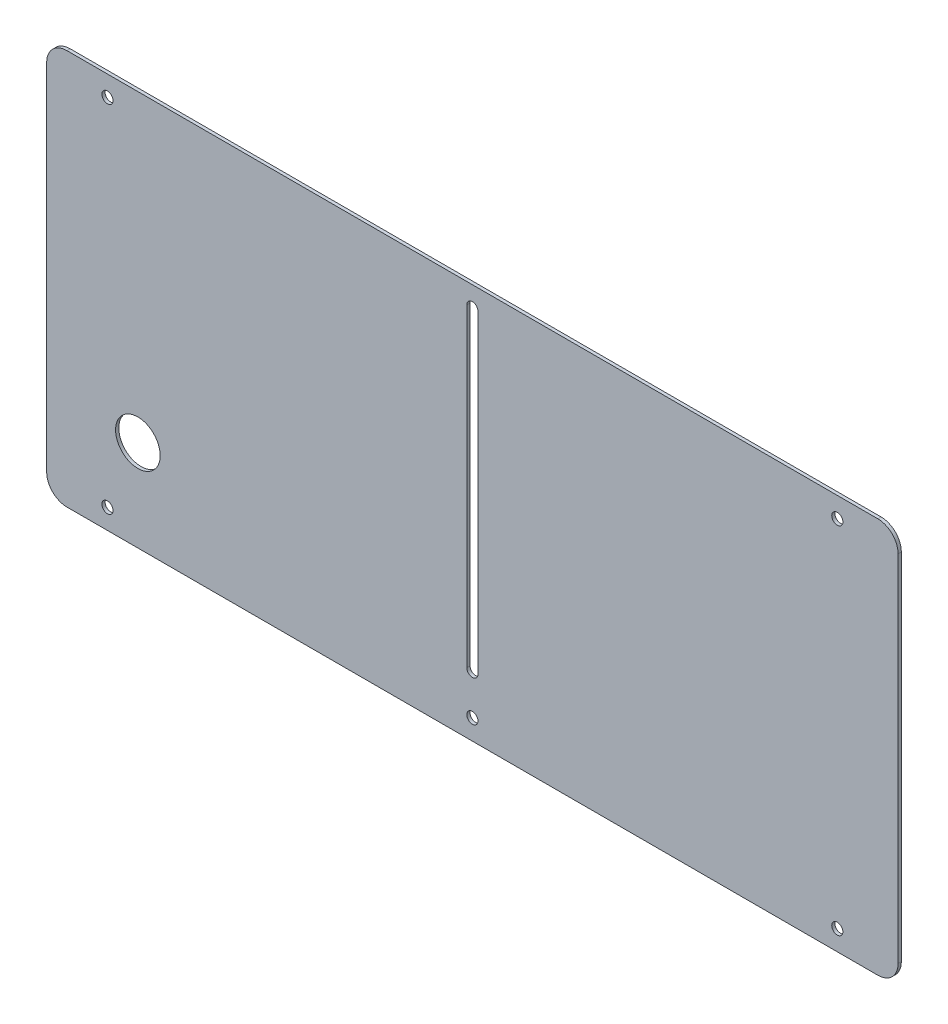
ISO-10303-21;
HEADER;
FILE_DESCRIPTION(('STEP AP214'),'2;1');
FILE_NAME('part.step','',(''),(''),'','','');
FILE_SCHEMA(('AUTOMOTIVE_DESIGN { 1 0 10303 214 1 1 1 1 }'));
ENDSEC;
DATA;
#1=APPLICATION_CONTEXT('core data for automotive mechanical design processes');
#2=APPLICATION_PROTOCOL_DEFINITION('international standard','automotive_design',2000,#1);
#3=PRODUCT_CONTEXT('',#1,'mechanical');
#4=PRODUCT('Part','Part','',(#3));
#5=PRODUCT_RELATED_PRODUCT_CATEGORY('part','',(#4));
#6=PRODUCT_DEFINITION_FORMATION('','',#4);
#7=PRODUCT_DEFINITION_CONTEXT('part definition',#1,'design');
#8=PRODUCT_DEFINITION('design','',#6,#7);
#9=PRODUCT_DEFINITION_SHAPE('','',#8);
#10=(LENGTH_UNIT() NAMED_UNIT(*) SI_UNIT(.MILLI.,.METRE.));
#11=(NAMED_UNIT(*) PLANE_ANGLE_UNIT() SI_UNIT($,.RADIAN.));
#12=(NAMED_UNIT(*) SI_UNIT($,.STERADIAN.) SOLID_ANGLE_UNIT());
#13=UNCERTAINTY_MEASURE_WITH_UNIT(LENGTH_MEASURE(1.E-05),#10,'distance_accuracy_value','');
#14=(GEOMETRIC_REPRESENTATION_CONTEXT(3) GLOBAL_UNCERTAINTY_ASSIGNED_CONTEXT((#13)) GLOBAL_UNIT_ASSIGNED_CONTEXT((#10,
#11,#12)) REPRESENTATION_CONTEXT('',''));
#15=CARTESIAN_POINT('',(0.,0.,0.));
#16=DIRECTION('',(0.,0.,1.));
#17=DIRECTION('',(1.,0.,0.));
#18=AXIS2_PLACEMENT_3D('',#15,#16,#17);
#19=CARTESIAN_POINT('',(2.72527919099535E-13,0.,-343.508212503052));
#20=DIRECTION('',(0.,0.,-1.));
#21=DIRECTION('',(-1.,0.,0.));
#22=AXIS2_PLACEMENT_3D('',#19,#20,#21);
#23=PLANE('',#22);
#24=CARTESIAN_POINT('',(180.0102,-72.5898,-343.508212503052));
#25=DIRECTION('',(0.,0.,-1.));
#26=DIRECTION('',(-1.,0.,0.));
#27=AXIS2_PLACEMENT_3D('',#24,#25,#26);
#28=CIRCLE('',#27,2.75000000000001);
#29=CARTESIAN_POINT('',(177.2602,-72.5898,-343.508212503052));
#30=VERTEX_POINT('',#29);
#31=EDGE_CURVE('E460',#30,#30,#28,.T.);
#32=ORIENTED_EDGE('',*,*,#31,.F.);
#33=EDGE_LOOP('',(#32));
#34=FACE_BOUND('',#33,.T.);
#35=CARTESIAN_POINT('',(-180.010199999999,-72.5898,-343.508212503052));
#36=DIRECTION('',(0.,0.,-1.));
#37=DIRECTION('',(-1.,0.,0.));
#38=AXIS2_PLACEMENT_3D('',#35,#36,#37);
#39=CIRCLE('',#38,2.75000000000001);
#40=CARTESIAN_POINT('',(-182.760199999999,-72.5898,-343.508212503052));
#41=VERTEX_POINT('',#40);
#42=EDGE_CURVE('E483',#41,#41,#39,.T.);
#43=ORIENTED_EDGE('',*,*,#42,.F.);
#44=EDGE_LOOP('',(#43));
#45=FACE_BOUND('',#44,.T.);
#46=CARTESIAN_POINT('',(-180.010199999999,102.5153,-343.508212503052));
#47=DIRECTION('',(0.,0.,-1.));
#48=DIRECTION('',(1.,0.,0.));
#49=AXIS2_PLACEMENT_3D('',#46,#47,#48);
#50=CIRCLE('',#49,2.75000000000001);
#51=CARTESIAN_POINT('',(-177.260199999999,102.5153,-343.508212503052));
#52=VERTEX_POINT('',#51);
#53=EDGE_CURVE('E464',#52,#52,#50,.T.);
#54=ORIENTED_EDGE('',*,*,#53,.F.);
#55=EDGE_LOOP('',(#54));
#56=FACE_BOUND('',#55,.T.);
#57=CARTESIAN_POINT('',(0.,-72.4998,-343.508212503052));
#58=DIRECTION('',(0.,0.,-1.));
#59=DIRECTION('',(-1.,0.,0.));
#60=AXIS2_PLACEMENT_3D('',#57,#58,#59);
#61=CIRCLE('',#60,2.75);
#62=CARTESIAN_POINT('',(-2.75000000000003,-72.4998,-343.508212503052));
#63=VERTEX_POINT('',#62);
#64=EDGE_CURVE('E161',#63,#63,#61,.T.);
#65=ORIENTED_EDGE('',*,*,#64,.F.);
#66=EDGE_LOOP('',(#65));
#67=FACE_BOUND('',#66,.T.);
#68=DIRECTION('',(0.,-1.,0.));
#69=VECTOR('',#68,1.);
#70=CARTESIAN_POINT('',(210.,112.5102,-343.508212503052));
#71=LINE('',#70,#69);
#72=CARTESIAN_POINT('',(210.,102.5102,-343.508212503052));
#73=VERTEX_POINT('',#72);
#74=CARTESIAN_POINT('',(210.,-72.4898,-343.508212503052));
#75=VERTEX_POINT('',#74);
#76=EDGE_CURVE('E172',#73,#75,#71,.T.);
#77=ORIENTED_EDGE('',*,*,#76,.T.);
#78=CARTESIAN_POINT('',(200.,-72.4898,-343.508212503052));
#79=DIRECTION('',(0.,0.,-1.));
#80=DIRECTION('',(-1.,0.,0.));
#81=AXIS2_PLACEMENT_3D('',#78,#79,#80);
#82=CIRCLE('',#81,10.);
#83=CARTESIAN_POINT('',(200.,-82.4898,-343.508212503052));
#84=VERTEX_POINT('',#83);
#85=EDGE_CURVE('E215',#75,#84,#82,.T.);
#86=ORIENTED_EDGE('',*,*,#85,.T.);
#87=DIRECTION('',(-1.,0.,0.));
#88=VECTOR('',#87,1.);
#89=CARTESIAN_POINT('',(210.,-82.4898,-343.508212503052));
#90=LINE('',#89,#88);
#91=CARTESIAN_POINT('',(-200.,-82.4898,-343.508212503052));
#92=VERTEX_POINT('',#91);
#93=EDGE_CURVE('E175',#84,#92,#90,.T.);
#94=ORIENTED_EDGE('',*,*,#93,.T.);
#95=CARTESIAN_POINT('',(-200.,-72.4898,-343.508212503052));
#96=DIRECTION('',(0.,0.,-1.));
#97=DIRECTION('',(-1.,0.,0.));
#98=AXIS2_PLACEMENT_3D('',#95,#96,#97);
#99=CIRCLE('',#98,10.);
#100=CARTESIAN_POINT('',(-210.,-72.4898,-343.508212503052));
#101=VERTEX_POINT('',#100);
#102=EDGE_CURVE('E210',#92,#101,#99,.T.);
#103=ORIENTED_EDGE('',*,*,#102,.T.);
#104=DIRECTION('',(0.,1.,0.));
#105=VECTOR('',#104,1.);
#106=CARTESIAN_POINT('',(-210.,112.5102,-343.508212503052));
#107=LINE('',#106,#105);
#108=CARTESIAN_POINT('',(-210.,102.5102,-343.508212503052));
#109=VERTEX_POINT('',#108);
#110=EDGE_CURVE('E179',#101,#109,#107,.T.);
#111=ORIENTED_EDGE('',*,*,#110,.T.);
#112=CARTESIAN_POINT('',(-200.,102.5102,-343.508212503052));
#113=DIRECTION('',(0.,0.,-1.));
#114=DIRECTION('',(-1.,0.,0.));
#115=AXIS2_PLACEMENT_3D('',#112,#113,#114);
#116=CIRCLE('',#115,10.);
#117=CARTESIAN_POINT('',(-200.,112.5102,-343.508212503052));
#118=VERTEX_POINT('',#117);
#119=EDGE_CURVE('E59',#109,#118,#116,.T.);
#120=ORIENTED_EDGE('',*,*,#119,.T.);
#121=DIRECTION('',(1.,0.,0.));
#122=VECTOR('',#121,1.);
#123=CARTESIAN_POINT('',(210.,112.5102,-343.508212503052));
#124=LINE('',#123,#122);
#125=CARTESIAN_POINT('',(200.,112.5102,-343.508212503052));
#126=VERTEX_POINT('',#125);
#127=EDGE_CURVE('E181',#118,#126,#124,.T.);
#128=ORIENTED_EDGE('',*,*,#127,.T.);
#129=CARTESIAN_POINT('',(200.,102.5102,-343.508212503052));
#130=DIRECTION('',(0.,0.,-1.));
#131=DIRECTION('',(-1.,0.,0.));
#132=AXIS2_PLACEMENT_3D('',#129,#130,#131);
#133=CIRCLE('',#132,10.);
#134=EDGE_CURVE('E213',#126,#73,#133,.T.);
#135=ORIENTED_EDGE('',*,*,#134,.T.);
#136=EDGE_LOOP('',(#77,#86,#94,#103,#111,#120,#128,#135));
#137=FACE_BOUND('',#136,.T.);
#138=DIRECTION('',(0.,-1.,0.));
#139=VECTOR('',#138,1.);
#140=CARTESIAN_POINT('',(2.74999999999999,102.5153,-343.508212503052));
#141=LINE('',#140,#139);
#142=CARTESIAN_POINT('',(2.74999999999999,102.5153,-343.508212503052));
#143=VERTEX_POINT('',#142);
#144=CARTESIAN_POINT('',(2.74999999999997,-52.5,-343.508212503052));
#145=VERTEX_POINT('',#144);
#146=EDGE_CURVE('E138',#143,#145,#141,.T.);
#147=ORIENTED_EDGE('',*,*,#146,.F.);
#148=CARTESIAN_POINT('',(0.,102.5153,-343.508212503052));
#149=DIRECTION('',(0.,0.,-1.));
#150=DIRECTION('',(-1.,0.,0.));
#151=AXIS2_PLACEMENT_3D('',#148,#149,#150);
#152=CIRCLE('',#151,2.75);
#153=CARTESIAN_POINT('',(-2.75000000000001,102.5153,-343.508212503052));
#154=VERTEX_POINT('',#153);
#155=EDGE_CURVE('E128',#154,#143,#152,.T.);
#156=ORIENTED_EDGE('',*,*,#155,.F.);
#157=DIRECTION('',(0.,1.,0.));
#158=VECTOR('',#157,1.);
#159=CARTESIAN_POINT('',(-2.75000000000001,102.5153,-343.508212503052));
#160=LINE('',#159,#158);
#161=CARTESIAN_POINT('',(-2.75000000000002,-52.5,-343.508212503052));
#162=VERTEX_POINT('',#161);
#163=EDGE_CURVE('E154',#162,#154,#160,.T.);
#164=ORIENTED_EDGE('',*,*,#163,.F.);
#165=CARTESIAN_POINT('',(0.,-52.5,-343.508212503052));
#166=DIRECTION('',(0.,0.,-1.));
#167=DIRECTION('',(-1.,0.,0.));
#168=AXIS2_PLACEMENT_3D('',#165,#166,#167);
#169=CIRCLE('',#168,2.75);
#170=EDGE_CURVE('E152',#145,#162,#169,.T.);
#171=ORIENTED_EDGE('',*,*,#170,.F.);
#172=EDGE_LOOP('',(#147,#156,#164,#171));
#173=FACE_BOUND('',#172,.T.);
#174=CARTESIAN_POINT('',(180.0102,102.5153,-343.508212503052));
#175=DIRECTION('',(0.,0.,-1.));
#176=DIRECTION('',(-1.,0.,0.));
#177=AXIS2_PLACEMENT_3D('',#174,#175,#176);
#178=CIRCLE('',#177,2.75000000000001);
#179=CARTESIAN_POINT('',(177.2602,102.5153,-343.508212503052));
#180=VERTEX_POINT('',#179);
#181=EDGE_CURVE('E468',#180,#180,#178,.T.);
#182=ORIENTED_EDGE('',*,*,#181,.F.);
#183=EDGE_LOOP('',(#182));
#184=FACE_BOUND('',#183,.T.);
#185=CARTESIAN_POINT('',(-165.0102,-37.5,-343.508212503052));
#186=DIRECTION('',(0.,0.,-1.));
#187=DIRECTION('',(-1.,0.,0.));
#188=AXIS2_PLACEMENT_3D('',#185,#186,#187);
#189=CIRCLE('',#188,11.);
#190=CARTESIAN_POINT('',(-176.0102,-37.5,-343.508212503052));
#191=VERTEX_POINT('',#190);
#192=EDGE_CURVE('E454',#191,#191,#189,.T.);
#193=ORIENTED_EDGE('',*,*,#192,.F.);
#194=EDGE_LOOP('',(#193));
#195=FACE_BOUND('',#194,.T.);
#196=ADVANCED_FACE('F37',(#34,#45,#56,#67,#137,#173,#184,#195),#23,.T.);
#197=CARTESIAN_POINT('',(2.71148748297948E-13,0.,-341.920712503052));
#198=DIRECTION('',(0.,0.,-1.));
#199=DIRECTION('',(-1.,0.,0.));
#200=AXIS2_PLACEMENT_3D('',#197,#198,#199);
#201=PLANE('',#200);
#202=CARTESIAN_POINT('',(180.0102,-72.5898,-341.920712503051));
#203=DIRECTION('',(0.,0.,-1.));
#204=DIRECTION('',(-1.,0.,0.));
#205=AXIS2_PLACEMENT_3D('',#202,#203,#204);
#206=CIRCLE('',#205,2.75000000000001);
#207=CARTESIAN_POINT('',(177.2602,-72.5898,-341.920712503051));
#208=VERTEX_POINT('',#207);
#209=EDGE_CURVE('E455',#208,#208,#206,.T.);
#210=ORIENTED_EDGE('',*,*,#209,.T.);
#211=EDGE_LOOP('',(#210));
#212=FACE_BOUND('',#211,.T.);
#213=CARTESIAN_POINT('',(-180.010199999999,-72.5898,-341.920712503052));
#214=DIRECTION('',(0.,0.,-1.));
#215=DIRECTION('',(-1.,0.,0.));
#216=AXIS2_PLACEMENT_3D('',#213,#214,#215);
#217=CIRCLE('',#216,2.75000000000001);
#218=CARTESIAN_POINT('',(-182.760199999999,-72.5898,-341.920712503052));
#219=VERTEX_POINT('',#218);
#220=EDGE_CURVE('E486',#219,#219,#217,.T.);
#221=ORIENTED_EDGE('',*,*,#220,.T.);
#222=EDGE_LOOP('',(#221));
#223=FACE_BOUND('',#222,.T.);
#224=DIRECTION('',(-1.,0.,0.));
#225=VECTOR('',#224,1.);
#226=CARTESIAN_POINT('',(210.,-82.4898,-341.920712503052));
#227=LINE('',#226,#225);
#228=CARTESIAN_POINT('',(200.,-82.4898,-341.920712503052));
#229=VERTEX_POINT('',#228);
#230=CARTESIAN_POINT('',(-200.,-82.4898,-341.920712503052));
#231=VERTEX_POINT('',#230);
#232=EDGE_CURVE('E186',#229,#231,#227,.T.);
#233=ORIENTED_EDGE('',*,*,#232,.F.);
#234=CARTESIAN_POINT('',(200.,-72.4898,-341.920712503052));
#235=DIRECTION('',(0.,0.,-1.));
#236=DIRECTION('',(-1.,0.,0.));
#237=AXIS2_PLACEMENT_3D('',#234,#235,#236);
#238=CIRCLE('',#237,10.);
#239=CARTESIAN_POINT('',(210.,-72.4898,-341.920712503052));
#240=VERTEX_POINT('',#239);
#241=EDGE_CURVE('E203',#229,#240,#238,.F.);
#242=ORIENTED_EDGE('',*,*,#241,.T.);
#243=DIRECTION('',(0.,-1.,0.));
#244=VECTOR('',#243,1.);
#245=CARTESIAN_POINT('',(210.,112.5102,-341.920712503052));
#246=LINE('',#245,#244);
#247=CARTESIAN_POINT('',(210.,102.5102,-341.920712503052));
#248=VERTEX_POINT('',#247);
#249=EDGE_CURVE('E146',#248,#240,#246,.T.);
#250=ORIENTED_EDGE('',*,*,#249,.F.);
#251=CARTESIAN_POINT('',(200.,102.5102,-341.920712503052));
#252=DIRECTION('',(0.,0.,-1.));
#253=DIRECTION('',(-1.,0.,0.));
#254=AXIS2_PLACEMENT_3D('',#251,#252,#253);
#255=CIRCLE('',#254,10.);
#256=CARTESIAN_POINT('',(200.,112.5102,-341.920712503052));
#257=VERTEX_POINT('',#256);
#258=EDGE_CURVE('E201',#248,#257,#255,.F.);
#259=ORIENTED_EDGE('',*,*,#258,.T.);
#260=DIRECTION('',(1.,0.,0.));
#261=VECTOR('',#260,1.);
#262=CARTESIAN_POINT('',(210.,112.5102,-341.920712503052));
#263=LINE('',#262,#261);
#264=CARTESIAN_POINT('',(-200.,112.5102,-341.920712503052));
#265=VERTEX_POINT('',#264);
#266=EDGE_CURVE('E176',#265,#257,#263,.T.);
#267=ORIENTED_EDGE('',*,*,#266,.F.);
#268=CARTESIAN_POINT('',(-200.,102.5102,-341.920712503052));
#269=DIRECTION('',(0.,0.,-1.));
#270=DIRECTION('',(-1.,0.,0.));
#271=AXIS2_PLACEMENT_3D('',#268,#269,#270);
#272=CIRCLE('',#271,10.);
#273=CARTESIAN_POINT('',(-210.,102.5102,-341.920712503052));
#274=VERTEX_POINT('',#273);
#275=EDGE_CURVE('E199',#265,#274,#272,.F.);
#276=ORIENTED_EDGE('',*,*,#275,.T.);
#277=DIRECTION('',(0.,1.,0.));
#278=VECTOR('',#277,1.);
#279=CARTESIAN_POINT('',(-210.,112.5102,-341.920712503052));
#280=LINE('',#279,#278);
#281=CARTESIAN_POINT('',(-210.,-72.4898,-341.920712503052));
#282=VERTEX_POINT('',#281);
#283=EDGE_CURVE('E189',#282,#274,#280,.T.);
#284=ORIENTED_EDGE('',*,*,#283,.F.);
#285=CARTESIAN_POINT('',(-200.,-72.4898,-341.920712503052));
#286=DIRECTION('',(0.,0.,-1.));
#287=DIRECTION('',(-1.,0.,0.));
#288=AXIS2_PLACEMENT_3D('',#285,#286,#287);
#289=CIRCLE('',#288,10.);
#290=EDGE_CURVE('E197',#282,#231,#289,.F.);
#291=ORIENTED_EDGE('',*,*,#290,.T.);
#292=EDGE_LOOP('',(#233,#242,#250,#259,#267,#276,#284,#291));
#293=FACE_BOUND('',#292,.T.);
#294=CARTESIAN_POINT('',(0.,102.5153,-341.920712503052));
#295=DIRECTION('',(0.,0.,-1.));
#296=DIRECTION('',(-1.,0.,0.));
#297=AXIS2_PLACEMENT_3D('',#294,#295,#296);
#298=CIRCLE('',#297,2.75);
#299=CARTESIAN_POINT('',(-2.75000000000001,102.5153,-341.920712503052));
#300=VERTEX_POINT('',#299);
#301=CARTESIAN_POINT('',(2.74999999999999,102.5153,-341.920712503052));
#302=VERTEX_POINT('',#301);
#303=EDGE_CURVE('E159',#300,#302,#298,.T.);
#304=ORIENTED_EDGE('',*,*,#303,.T.);
#305=DIRECTION('',(0.,-1.,0.));
#306=VECTOR('',#305,1.);
#307=CARTESIAN_POINT('',(2.74999999999999,102.5153,-341.920712503052));
#308=LINE('',#307,#306);
#309=CARTESIAN_POINT('',(2.74999999999996,-52.5,-341.920712503052));
#310=VERTEX_POINT('',#309);
#311=EDGE_CURVE('E145',#302,#310,#308,.T.);
#312=ORIENTED_EDGE('',*,*,#311,.T.);
#313=CARTESIAN_POINT('',(0.,-52.5,-341.920712503052));
#314=DIRECTION('',(0.,0.,-1.));
#315=DIRECTION('',(-1.,0.,0.));
#316=AXIS2_PLACEMENT_3D('',#313,#314,#315);
#317=CIRCLE('',#316,2.75);
#318=CARTESIAN_POINT('',(-2.75000000000002,-52.5,-341.920712503052));
#319=VERTEX_POINT('',#318);
#320=EDGE_CURVE('E163',#310,#319,#317,.T.);
#321=ORIENTED_EDGE('',*,*,#320,.T.);
#322=DIRECTION('',(0.,1.,0.));
#323=VECTOR('',#322,1.);
#324=CARTESIAN_POINT('',(-2.75000000000001,102.5153,-341.920712503052));
#325=LINE('',#324,#323);
#326=EDGE_CURVE('E139',#319,#300,#325,.T.);
#327=ORIENTED_EDGE('',*,*,#326,.T.);
#328=EDGE_LOOP('',(#304,#312,#321,#327));
#329=FACE_BOUND('',#328,.T.);
#330=CARTESIAN_POINT('',(0.,-72.4998,-341.920712503052));
#331=DIRECTION('',(0.,0.,-1.));
#332=DIRECTION('',(-1.,0.,0.));
#333=AXIS2_PLACEMENT_3D('',#330,#331,#332);
#334=CIRCLE('',#333,2.75);
#335=CARTESIAN_POINT('',(-2.75000000000003,-72.4998,-341.920712503052));
#336=VERTEX_POINT('',#335);
#337=EDGE_CURVE('E441',#336,#336,#334,.T.);
#338=ORIENTED_EDGE('',*,*,#337,.T.);
#339=EDGE_LOOP('',(#338));
#340=FACE_BOUND('',#339,.T.);
#341=CARTESIAN_POINT('',(180.0102,102.5153,-341.920712503052));
#342=DIRECTION('',(0.,0.,-1.));
#343=DIRECTION('',(-1.,0.,0.));
#344=AXIS2_PLACEMENT_3D('',#341,#342,#343);
#345=CIRCLE('',#344,2.75000000000001);
#346=CARTESIAN_POINT('',(177.2602,102.5153,-341.920712503052));
#347=VERTEX_POINT('',#346);
#348=EDGE_CURVE('E445',#347,#347,#345,.T.);
#349=ORIENTED_EDGE('',*,*,#348,.T.);
#350=EDGE_LOOP('',(#349));
#351=FACE_BOUND('',#350,.T.);
#352=CARTESIAN_POINT('',(-180.010199999999,102.5153,-341.920712503052));
#353=DIRECTION('',(0.,0.,-1.));
#354=DIRECTION('',(1.,0.,0.));
#355=AXIS2_PLACEMENT_3D('',#352,#353,#354);
#356=CIRCLE('',#355,2.75000000000001);
#357=CARTESIAN_POINT('',(-177.260199999999,102.5153,-341.920712503052));
#358=VERTEX_POINT('',#357);
#359=EDGE_CURVE('E449',#358,#358,#356,.T.);
#360=ORIENTED_EDGE('',*,*,#359,.T.);
#361=EDGE_LOOP('',(#360));
#362=FACE_BOUND('',#361,.T.);
#363=CARTESIAN_POINT('',(-165.0102,-37.5,-341.920712503052));
#364=DIRECTION('',(0.,0.,-1.));
#365=DIRECTION('',(-1.,0.,0.));
#366=AXIS2_PLACEMENT_3D('',#363,#364,#365);
#367=CIRCLE('',#366,11.);
#368=CARTESIAN_POINT('',(-176.0102,-37.5,-341.920712503052));
#369=VERTEX_POINT('',#368);
#370=EDGE_CURVE('E452',#369,#369,#367,.T.);
#371=ORIENTED_EDGE('',*,*,#370,.T.);
#372=EDGE_LOOP('',(#371));
#373=FACE_BOUND('',#372,.T.);
#374=ADVANCED_FACE('F231',(#212,#223,#293,#329,#340,#351,#362,#373),#201,.F.);
#375=CARTESIAN_POINT('',(210.,112.5102,-343.508212503052));
#376=DIRECTION('',(-1.,0.,0.));
#377=DIRECTION('',(0.,0.,1.));
#378=AXIS2_PLACEMENT_3D('',#375,#376,#377);
#379=PLANE('',#378);
#380=ORIENTED_EDGE('',*,*,#249,.T.);
#381=DIRECTION('',(0.,0.,1.));
#382=VECTOR('',#381,1.);
#383=CARTESIAN_POINT('',(210.,-72.4898,-343.508212503052));
#384=LINE('',#383,#382);
#385=EDGE_CURVE('E208',#240,#75,#384,.F.);
#386=ORIENTED_EDGE('',*,*,#385,.T.);
#387=ORIENTED_EDGE('',*,*,#76,.F.);
#388=DIRECTION('',(0.,0.,1.));
#389=VECTOR('',#388,1.);
#390=CARTESIAN_POINT('',(210.,102.5102,-343.508212503052));
#391=LINE('',#390,#389);
#392=EDGE_CURVE('E205',#73,#248,#391,.T.);
#393=ORIENTED_EDGE('',*,*,#392,.T.);
#394=EDGE_LOOP('',(#380,#386,#387,#393));
#395=FACE_BOUND('',#394,.T.);
#396=ADVANCED_FACE('F245',(#395),#379,.F.);
#397=CARTESIAN_POINT('',(210.,-82.4898,-343.508212503052));
#398=DIRECTION('',(0.,1.,0.));
#399=DIRECTION('',(-1.,0.,0.));
#400=AXIS2_PLACEMENT_3D('',#397,#398,#399);
#401=PLANE('',#400);
#402=ORIENTED_EDGE('',*,*,#93,.F.);
#403=DIRECTION('',(0.,0.,1.));
#404=VECTOR('',#403,1.);
#405=CARTESIAN_POINT('',(200.,-82.4898,-343.508212503052));
#406=LINE('',#405,#404);
#407=EDGE_CURVE('E194',#84,#229,#406,.T.);
#408=ORIENTED_EDGE('',*,*,#407,.T.);
#409=ORIENTED_EDGE('',*,*,#232,.T.);
#410=DIRECTION('',(0.,0.,1.));
#411=VECTOR('',#410,1.);
#412=CARTESIAN_POINT('',(-200.,-82.4898,-343.508212503052));
#413=LINE('',#412,#411);
#414=EDGE_CURVE('E183',#231,#92,#413,.F.);
#415=ORIENTED_EDGE('',*,*,#414,.T.);
#416=EDGE_LOOP('',(#402,#408,#409,#415));
#417=FACE_BOUND('',#416,.T.);
#418=ADVANCED_FACE('F253',(#417),#401,.F.);
#419=CARTESIAN_POINT('',(-210.,112.5102,-343.508212503052));
#420=DIRECTION('',(1.,0.,0.));
#421=DIRECTION('',(0.,0.,-1.));
#422=AXIS2_PLACEMENT_3D('',#419,#420,#421);
#423=PLANE('',#422);
#424=ORIENTED_EDGE('',*,*,#283,.T.);
#425=DIRECTION('',(0.,0.,1.));
#426=VECTOR('',#425,1.);
#427=CARTESIAN_POINT('',(-210.,102.5102,-343.508212503052));
#428=LINE('',#427,#426);
#429=EDGE_CURVE('E11',#274,#109,#428,.F.);
#430=ORIENTED_EDGE('',*,*,#429,.T.);
#431=ORIENTED_EDGE('',*,*,#110,.F.);
#432=DIRECTION('',(0.,0.,1.));
#433=VECTOR('',#432,1.);
#434=CARTESIAN_POINT('',(-210.,-72.4898,-343.508212503052));
#435=LINE('',#434,#433);
#436=EDGE_CURVE('E45',#101,#282,#435,.T.);
#437=ORIENTED_EDGE('',*,*,#436,.T.);
#438=EDGE_LOOP('',(#424,#430,#431,#437));
#439=FACE_BOUND('',#438,.T.);
#440=ADVANCED_FACE('F225',(#439),#423,.F.);
#441=CARTESIAN_POINT('',(210.,112.5102,-343.508212503052));
#442=DIRECTION('',(0.,-1.,0.));
#443=DIRECTION('',(1.,0.,0.));
#444=AXIS2_PLACEMENT_3D('',#441,#442,#443);
#445=PLANE('',#444);
#446=ORIENTED_EDGE('',*,*,#266,.T.);
#447=DIRECTION('',(0.,0.,1.));
#448=VECTOR('',#447,1.);
#449=CARTESIAN_POINT('',(200.,112.5102,-343.508212503052));
#450=LINE('',#449,#448);
#451=EDGE_CURVE('E52',#257,#126,#450,.F.);
#452=ORIENTED_EDGE('',*,*,#451,.T.);
#453=ORIENTED_EDGE('',*,*,#127,.F.);
#454=DIRECTION('',(0.,0.,1.));
#455=VECTOR('',#454,1.);
#456=CARTESIAN_POINT('',(-200.,112.5102,-343.508212503052));
#457=LINE('',#456,#455);
#458=EDGE_CURVE('E217',#118,#265,#457,.T.);
#459=ORIENTED_EDGE('',*,*,#458,.T.);
#460=EDGE_LOOP('',(#446,#452,#453,#459));
#461=FACE_BOUND('',#460,.T.);
#462=ADVANCED_FACE('F237',(#461),#445,.F.);
#463=CARTESIAN_POINT('',(0.,102.5153,-343.508212503052));
#464=DIRECTION('',(0.,0.,1.));
#465=DIRECTION('',(1.,0.,0.));
#466=AXIS2_PLACEMENT_3D('',#463,#464,#465);
#467=CYLINDRICAL_SURFACE('',#466,2.75);
#468=ORIENTED_EDGE('',*,*,#303,.F.);
#469=DIRECTION('',(0.,0.,1.));
#470=VECTOR('',#469,1.);
#471=CARTESIAN_POINT('',(-2.75000000000001,102.5153,-343.508212503052));
#472=LINE('',#471,#470);
#473=EDGE_CURVE('E134',#154,#300,#472,.T.);
#474=ORIENTED_EDGE('',*,*,#473,.F.);
#475=ORIENTED_EDGE('',*,*,#155,.T.);
#476=DIRECTION('',(0.,0.,1.));
#477=VECTOR('',#476,1.);
#478=CARTESIAN_POINT('',(2.74999999999999,102.5153,-343.508212503052));
#479=LINE('',#478,#477);
#480=EDGE_CURVE('E131',#143,#302,#479,.T.);
#481=ORIENTED_EDGE('',*,*,#480,.T.);
#482=EDGE_LOOP('',(#468,#474,#475,#481));
#483=FACE_BOUND('',#482,.T.);
#484=ADVANCED_FACE('F130',(#483),#467,.F.);
#485=CARTESIAN_POINT('',(2.74999999999999,102.5153,-343.508212503052));
#486=DIRECTION('',(-1.,0.,0.));
#487=DIRECTION('',(0.,0.,1.));
#488=AXIS2_PLACEMENT_3D('',#485,#486,#487);
#489=PLANE('',#488);
#490=ORIENTED_EDGE('',*,*,#311,.F.);
#491=ORIENTED_EDGE('',*,*,#480,.F.);
#492=ORIENTED_EDGE('',*,*,#146,.T.);
#493=DIRECTION('',(0.,0.,1.));
#494=VECTOR('',#493,1.);
#495=CARTESIAN_POINT('',(2.74999999999997,-52.5,-343.508212503052));
#496=LINE('',#495,#494);
#497=EDGE_CURVE('E147',#145,#310,#496,.T.);
#498=ORIENTED_EDGE('',*,*,#497,.T.);
#499=EDGE_LOOP('',(#490,#491,#492,#498));
#500=FACE_BOUND('',#499,.T.);
#501=ADVANCED_FACE('F142',(#500),#489,.T.);
#502=CARTESIAN_POINT('',(0.,-52.5,-343.508212503052));
#503=DIRECTION('',(0.,0.,1.));
#504=DIRECTION('',(1.,0.,0.));
#505=AXIS2_PLACEMENT_3D('',#502,#503,#504);
#506=CYLINDRICAL_SURFACE('',#505,2.75);
#507=ORIENTED_EDGE('',*,*,#320,.F.);
#508=ORIENTED_EDGE('',*,*,#497,.F.);
#509=ORIENTED_EDGE('',*,*,#170,.T.);
#510=DIRECTION('',(0.,0.,1.));
#511=VECTOR('',#510,1.);
#512=CARTESIAN_POINT('',(-2.75000000000002,-52.5,-343.508212503052));
#513=LINE('',#512,#511);
#514=EDGE_CURVE('E169',#162,#319,#513,.T.);
#515=ORIENTED_EDGE('',*,*,#514,.T.);
#516=EDGE_LOOP('',(#507,#508,#509,#515));
#517=FACE_BOUND('',#516,.T.);
#518=ADVANCED_FACE('F352',(#517),#506,.F.);
#519=CARTESIAN_POINT('',(-2.75000000000001,102.5153,-343.508212503052));
#520=DIRECTION('',(1.,0.,0.));
#521=DIRECTION('',(0.,0.,-1.));
#522=AXIS2_PLACEMENT_3D('',#519,#520,#521);
#523=PLANE('',#522);
#524=ORIENTED_EDGE('',*,*,#326,.F.);
#525=ORIENTED_EDGE('',*,*,#514,.F.);
#526=ORIENTED_EDGE('',*,*,#163,.T.);
#527=ORIENTED_EDGE('',*,*,#473,.T.);
#528=EDGE_LOOP('',(#524,#525,#526,#527));
#529=FACE_BOUND('',#528,.T.);
#530=ADVANCED_FACE('F348',(#529),#523,.T.);
#531=CARTESIAN_POINT('',(0.,-72.4998,-343.508212503052));
#532=DIRECTION('',(0.,0.,1.));
#533=DIRECTION('',(1.,0.,0.));
#534=AXIS2_PLACEMENT_3D('',#531,#532,#533);
#535=CYLINDRICAL_SURFACE('',#534,2.75);
#536=ORIENTED_EDGE('',*,*,#64,.T.);
#537=EDGE_LOOP('',(#536));
#538=FACE_BOUND('',#537,.T.);
#539=ORIENTED_EDGE('',*,*,#337,.F.);
#540=EDGE_LOOP('',(#539));
#541=FACE_BOUND('',#540,.T.);
#542=ADVANCED_FACE('F344',(#538,#541),#535,.F.);
#543=CARTESIAN_POINT('',(180.0102,102.5153,-343.508212503052));
#544=DIRECTION('',(0.,0.,1.));
#545=DIRECTION('',(1.,0.,0.));
#546=AXIS2_PLACEMENT_3D('',#543,#544,#545);
#547=CYLINDRICAL_SURFACE('',#546,2.75000000000001);
#548=ORIENTED_EDGE('',*,*,#181,.T.);
#549=EDGE_LOOP('',(#548));
#550=FACE_BOUND('',#549,.T.);
#551=ORIENTED_EDGE('',*,*,#348,.F.);
#552=EDGE_LOOP('',(#551));
#553=FACE_BOUND('',#552,.T.);
#554=ADVANCED_FACE('F340',(#550,#553),#547,.F.);
#555=CARTESIAN_POINT('',(-180.010199999999,102.5153,-343.508212503052));
#556=DIRECTION('',(0.,0.,1.));
#557=DIRECTION('',(1.,0.,0.));
#558=AXIS2_PLACEMENT_3D('',#555,#556,#557);
#559=CYLINDRICAL_SURFACE('',#558,2.75000000000001);
#560=ORIENTED_EDGE('',*,*,#53,.T.);
#561=EDGE_LOOP('',(#560));
#562=FACE_BOUND('',#561,.T.);
#563=ORIENTED_EDGE('',*,*,#359,.F.);
#564=EDGE_LOOP('',(#563));
#565=FACE_BOUND('',#564,.T.);
#566=ADVANCED_FACE('F336',(#562,#565),#559,.F.);
#567=CARTESIAN_POINT('',(-165.0102,-37.5,-343.508212503052));
#568=DIRECTION('',(0.,0.,1.));
#569=DIRECTION('',(1.,0.,0.));
#570=AXIS2_PLACEMENT_3D('',#567,#568,#569);
#571=CYLINDRICAL_SURFACE('',#570,11.);
#572=ORIENTED_EDGE('',*,*,#192,.T.);
#573=EDGE_LOOP('',(#572));
#574=FACE_BOUND('',#573,.T.);
#575=ORIENTED_EDGE('',*,*,#370,.F.);
#576=EDGE_LOOP('',(#575));
#577=FACE_BOUND('',#576,.T.);
#578=ADVANCED_FACE('F287',(#574,#577),#571,.F.);
#579=CARTESIAN_POINT('',(200.,-72.4898,-343.508212503052));
#580=DIRECTION('',(0.,0.,1.));
#581=DIRECTION('',(1.,0.,0.));
#582=AXIS2_PLACEMENT_3D('',#579,#580,#581);
#583=CYLINDRICAL_SURFACE('',#582,10.);
#584=ORIENTED_EDGE('',*,*,#85,.F.);
#585=ORIENTED_EDGE('',*,*,#385,.F.);
#586=ORIENTED_EDGE('',*,*,#241,.F.);
#587=ORIENTED_EDGE('',*,*,#407,.F.);
#588=EDGE_LOOP('',(#584,#585,#586,#587));
#589=FACE_BOUND('',#588,.T.);
#590=ADVANCED_FACE('F250',(#589),#583,.T.);
#591=CARTESIAN_POINT('',(200.,102.5102,-343.508212503052));
#592=DIRECTION('',(0.,0.,1.));
#593=DIRECTION('',(1.,0.,0.));
#594=AXIS2_PLACEMENT_3D('',#591,#592,#593);
#595=CYLINDRICAL_SURFACE('',#594,10.);
#596=ORIENTED_EDGE('',*,*,#134,.F.);
#597=ORIENTED_EDGE('',*,*,#451,.F.);
#598=ORIENTED_EDGE('',*,*,#258,.F.);
#599=ORIENTED_EDGE('',*,*,#392,.F.);
#600=EDGE_LOOP('',(#596,#597,#598,#599));
#601=FACE_BOUND('',#600,.T.);
#602=ADVANCED_FACE('F242',(#601),#595,.T.);
#603=CARTESIAN_POINT('',(-200.,102.5102,-343.508212503052));
#604=DIRECTION('',(0.,0.,1.));
#605=DIRECTION('',(1.,0.,0.));
#606=AXIS2_PLACEMENT_3D('',#603,#604,#605);
#607=CYLINDRICAL_SURFACE('',#606,10.);
#608=ORIENTED_EDGE('',*,*,#119,.F.);
#609=ORIENTED_EDGE('',*,*,#429,.F.);
#610=ORIENTED_EDGE('',*,*,#275,.F.);
#611=ORIENTED_EDGE('',*,*,#458,.F.);
#612=EDGE_LOOP('',(#608,#609,#610,#611));
#613=FACE_BOUND('',#612,.T.);
#614=ADVANCED_FACE('F236',(#613),#607,.T.);
#615=CARTESIAN_POINT('',(-200.,-72.4898,-343.508212503052));
#616=DIRECTION('',(0.,0.,1.));
#617=DIRECTION('',(1.,0.,0.));
#618=AXIS2_PLACEMENT_3D('',#615,#616,#617);
#619=CYLINDRICAL_SURFACE('',#618,10.);
#620=ORIENTED_EDGE('',*,*,#102,.F.);
#621=ORIENTED_EDGE('',*,*,#414,.F.);
#622=ORIENTED_EDGE('',*,*,#290,.F.);
#623=ORIENTED_EDGE('',*,*,#436,.F.);
#624=EDGE_LOOP('',(#620,#621,#622,#623));
#625=FACE_BOUND('',#624,.T.);
#626=ADVANCED_FACE('F39',(#625),#619,.T.);
#627=CARTESIAN_POINT('',(-180.010199999999,-72.5898,-341.920712503052));
#628=DIRECTION('',(0.,0.,-1.));
#629=DIRECTION('',(-1.,0.,0.));
#630=AXIS2_PLACEMENT_3D('',#627,#628,#629);
#631=CYLINDRICAL_SURFACE('',#630,2.75000000000001);
#632=ORIENTED_EDGE('',*,*,#220,.F.);
#633=EDGE_LOOP('',(#632));
#634=FACE_BOUND('',#633,.T.);
#635=ORIENTED_EDGE('',*,*,#42,.T.);
#636=EDGE_LOOP('',(#635));
#637=FACE_BOUND('',#636,.T.);
#638=ADVANCED_FACE('F256',(#634,#637),#631,.F.);
#639=CARTESIAN_POINT('',(180.0102,-72.5898,-341.920712503051));
#640=DIRECTION('',(0.,0.,-1.));
#641=DIRECTION('',(-1.,0.,0.));
#642=AXIS2_PLACEMENT_3D('',#639,#640,#641);
#643=CYLINDRICAL_SURFACE('',#642,2.75000000000001);
#644=ORIENTED_EDGE('',*,*,#209,.F.);
#645=EDGE_LOOP('',(#644));
#646=FACE_BOUND('',#645,.T.);
#647=ORIENTED_EDGE('',*,*,#31,.T.);
#648=EDGE_LOOP('',(#647));
#649=FACE_BOUND('',#648,.T.);
#650=ADVANCED_FACE('F261',(#646,#649),#643,.F.);
#651=CLOSED_SHELL('',(#196,#374,#396,#418,#440,#462,#484,#501,#518,#530,#542,#554,#566,#578,
#590,#602,#614,#626,#638,#650));
#652=MANIFOLD_SOLID_BREP('B2',#651);
#653=ADVANCED_BREP_SHAPE_REPRESENTATION('',(#18,#652),#14);
#654=SHAPE_DEFINITION_REPRESENTATION(#9,#653);
ENDSEC;
END-ISO-10303-21;
